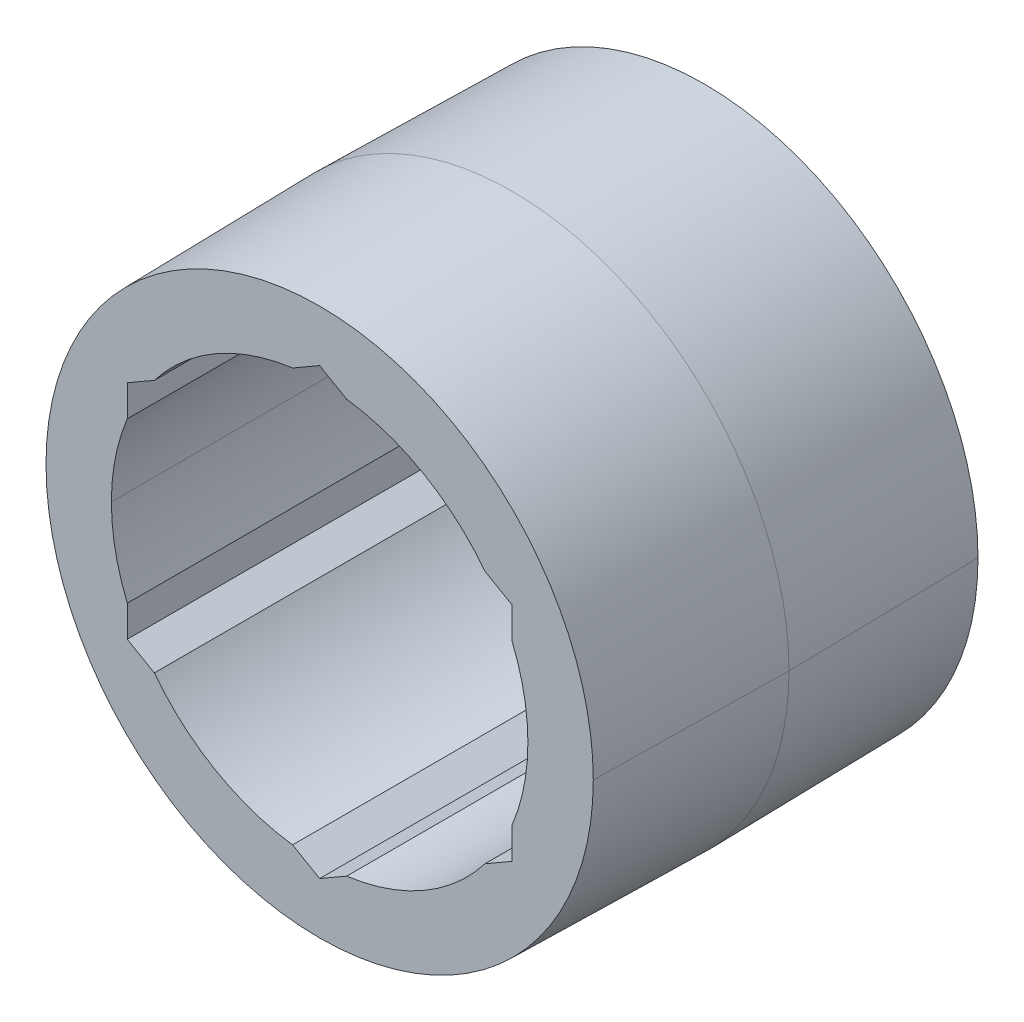
ISO-10303-21;
HEADER;
FILE_DESCRIPTION(('STEP AP214'),'2;1');
FILE_NAME('part.step','',(''),(''),'','','');
FILE_SCHEMA(('AUTOMOTIVE_DESIGN { 1 0 10303 214 1 1 1 1 }'));
ENDSEC;
DATA;
#1=APPLICATION_CONTEXT('core data for automotive mechanical design processes');
#2=APPLICATION_PROTOCOL_DEFINITION('international standard','automotive_design',2000,#1);
#3=PRODUCT_CONTEXT('',#1,'mechanical');
#4=PRODUCT('Part','Part','',(#3));
#5=PRODUCT_RELATED_PRODUCT_CATEGORY('part','',(#4));
#6=PRODUCT_DEFINITION_FORMATION('','',#4);
#7=PRODUCT_DEFINITION_CONTEXT('part definition',#1,'design');
#8=PRODUCT_DEFINITION('design','',#6,#7);
#9=PRODUCT_DEFINITION_SHAPE('','',#8);
#10=(LENGTH_UNIT() NAMED_UNIT(*) SI_UNIT(.MILLI.,.METRE.));
#11=(NAMED_UNIT(*) PLANE_ANGLE_UNIT() SI_UNIT($,.RADIAN.));
#12=(NAMED_UNIT(*) SI_UNIT($,.STERADIAN.) SOLID_ANGLE_UNIT());
#13=UNCERTAINTY_MEASURE_WITH_UNIT(LENGTH_MEASURE(1.E-05),#10,'distance_accuracy_value','');
#14=(GEOMETRIC_REPRESENTATION_CONTEXT(3) GLOBAL_UNCERTAINTY_ASSIGNED_CONTEXT((#13)) GLOBAL_UNIT_ASSIGNED_CONTEXT((#10,
#11,#12)) REPRESENTATION_CONTEXT('',''));
#15=CARTESIAN_POINT('',(0.,0.,0.));
#16=DIRECTION('',(0.,0.,1.));
#17=DIRECTION('',(1.,0.,0.));
#18=AXIS2_PLACEMENT_3D('',#15,#16,#17);
#19=CARTESIAN_POINT('',(0.,0.,-6.35));
#20=DIRECTION('',(0.,0.,1.));
#21=DIRECTION('',(1.,0.,0.));
#22=AXIS2_PLACEMENT_3D('',#19,#20,#21);
#23=PLANE('',#22);
#24=CARTESIAN_POINT('',(0.,0.,-6.35));
#25=DIRECTION('',(0.,0.,1.));
#26=DIRECTION('',(1.,0.,0.));
#27=AXIS2_PLACEMENT_3D('',#24,#25,#26);
#28=CIRCLE('',#27,6.874999966);
#29=CARTESIAN_POINT('',(5.45696042896782,4.18177084608655,-6.35));
#30=VERTEX_POINT('',#29);
#31=CARTESIAN_POINT('',(0.89303957103219,6.81675178197583,-6.35));
#32=VERTEX_POINT('',#31);
#33=EDGE_CURVE('E290',#30,#32,#28,.T.);
#34=ORIENTED_EDGE('',*,*,#33,.T.);
#35=DIRECTION('',(-0.866025403784439,0.5,0.));
#36=VECTOR('',#35,1.);
#37=CARTESIAN_POINT('',(3.175,5.49926131403119,-6.35));
#38=LINE('',#37,#36);
#39=CARTESIAN_POINT('',(0.,7.33234841870825,-6.35));
#40=VERTEX_POINT('',#39);
#41=EDGE_CURVE('E46',#32,#40,#38,.T.);
#42=ORIENTED_EDGE('',*,*,#41,.T.);
#43=DIRECTION('',(-0.866025403784439,-0.5,0.));
#44=VECTOR('',#43,1.);
#45=CARTESIAN_POINT('',(-3.175,5.49926131403119,-6.35));
#46=LINE('',#45,#44);
#47=CARTESIAN_POINT('',(-0.893039571032188,6.81675178197583,-6.35));
#48=VERTEX_POINT('',#47);
#49=EDGE_CURVE('E437',#40,#48,#46,.T.);
#50=ORIENTED_EDGE('',*,*,#49,.T.);
#51=CARTESIAN_POINT('',(0.,0.,-6.35));
#52=DIRECTION('',(0.,0.,1.));
#53=DIRECTION('',(1.,0.,0.));
#54=AXIS2_PLACEMENT_3D('',#51,#52,#53);
#55=CIRCLE('',#54,6.874999966);
#56=CARTESIAN_POINT('',(-5.45696042896781,4.18177084608655,-6.35));
#57=VERTEX_POINT('',#56);
#58=EDGE_CURVE('E413',#48,#57,#55,.T.);
#59=ORIENTED_EDGE('',*,*,#58,.T.);
#60=DIRECTION('',(-0.866025403784439,-0.5,0.));
#61=VECTOR('',#60,1.);
#62=CARTESIAN_POINT('',(-3.175,5.49926131403119,-6.35));
#63=LINE('',#62,#61);
#64=CARTESIAN_POINT('',(-6.35,3.66617420935413,-6.35));
#65=VERTEX_POINT('',#64);
#66=EDGE_CURVE('E387',#57,#65,#63,.T.);
#67=ORIENTED_EDGE('',*,*,#66,.T.);
#68=DIRECTION('',(0.,-1.,0.));
#69=VECTOR('',#68,1.);
#70=CARTESIAN_POINT('',(-6.35,0.,-6.35));
#71=LINE('',#70,#69);
#72=CARTESIAN_POINT('',(-6.35,2.63498093588929,-6.35));
#73=VERTEX_POINT('',#72);
#74=EDGE_CURVE('E262',#65,#73,#71,.T.);
#75=ORIENTED_EDGE('',*,*,#74,.T.);
#76=CARTESIAN_POINT('',(0.,0.,-6.35));
#77=DIRECTION('',(0.,0.,1.));
#78=DIRECTION('',(1.,0.,0.));
#79=AXIS2_PLACEMENT_3D('',#76,#77,#78);
#80=CIRCLE('',#79,6.874999966);
#81=CARTESIAN_POINT('',(-6.874999966,0.,-6.35));
#82=VERTEX_POINT('',#81);
#83=EDGE_CURVE('E274',#73,#82,#80,.T.);
#84=ORIENTED_EDGE('',*,*,#83,.T.);
#85=CARTESIAN_POINT('',(0.,0.,-6.35));
#86=DIRECTION('',(0.,0.,1.));
#87=DIRECTION('',(1.,0.,0.));
#88=AXIS2_PLACEMENT_3D('',#85,#86,#87);
#89=CIRCLE('',#88,6.874999966);
#90=CARTESIAN_POINT('',(-6.35,-2.63498093588929,-6.35));
#91=VERTEX_POINT('',#90);
#92=EDGE_CURVE('E266',#82,#91,#89,.T.);
#93=ORIENTED_EDGE('',*,*,#92,.T.);
#94=DIRECTION('',(0.,-1.,0.));
#95=VECTOR('',#94,1.);
#96=CARTESIAN_POINT('',(-6.35,0.,-6.35));
#97=LINE('',#96,#95);
#98=CARTESIAN_POINT('',(-6.35,-3.66617420935412,-6.35));
#99=VERTEX_POINT('',#98);
#100=EDGE_CURVE('E416',#91,#99,#97,.T.);
#101=ORIENTED_EDGE('',*,*,#100,.T.);
#102=DIRECTION('',(0.866025403784439,-0.5,0.));
#103=VECTOR('',#102,1.);
#104=CARTESIAN_POINT('',(-3.175,-5.49926131403119,-6.35));
#105=LINE('',#104,#103);
#106=CARTESIAN_POINT('',(-5.45696042896782,-4.18177084608655,-6.35));
#107=VERTEX_POINT('',#106);
#108=EDGE_CURVE('E400',#99,#107,#105,.T.);
#109=ORIENTED_EDGE('',*,*,#108,.T.);
#110=CARTESIAN_POINT('',(0.,0.,-6.35));
#111=DIRECTION('',(0.,0.,1.));
#112=DIRECTION('',(1.,0.,0.));
#113=AXIS2_PLACEMENT_3D('',#110,#111,#112);
#114=CIRCLE('',#113,6.874999966);
#115=CARTESIAN_POINT('',(-0.893039571032186,-6.81675178197583,-6.35));
#116=VERTEX_POINT('',#115);
#117=EDGE_CURVE('E390',#107,#116,#114,.T.);
#118=ORIENTED_EDGE('',*,*,#117,.T.);
#119=DIRECTION('',(0.866025403784439,-0.5,0.));
#120=VECTOR('',#119,1.);
#121=CARTESIAN_POINT('',(-3.175,-5.49926131403119,-6.35));
#122=LINE('',#121,#120);
#123=CARTESIAN_POINT('',(0.,-7.33234841870825,-6.35));
#124=VERTEX_POINT('',#123);
#125=EDGE_CURVE('E370',#116,#124,#122,.T.);
#126=ORIENTED_EDGE('',*,*,#125,.T.);
#127=DIRECTION('',(0.866025403784439,0.5,0.));
#128=VECTOR('',#127,1.);
#129=CARTESIAN_POINT('',(3.175,-5.49926131403119,-6.35));
#130=LINE('',#129,#128);
#131=CARTESIAN_POINT('',(0.893039571032181,-6.81675178197583,-6.35));
#132=VERTEX_POINT('',#131);
#133=EDGE_CURVE('E360',#124,#132,#130,.T.);
#134=ORIENTED_EDGE('',*,*,#133,.T.);
#135=CARTESIAN_POINT('',(0.,0.,-6.35));
#136=DIRECTION('',(0.,0.,1.));
#137=DIRECTION('',(1.,0.,0.));
#138=AXIS2_PLACEMENT_3D('',#135,#136,#137);
#139=CIRCLE('',#138,6.874999966);
#140=CARTESIAN_POINT('',(5.45696042896782,-4.18177084608655,-6.35));
#141=VERTEX_POINT('',#140);
#142=EDGE_CURVE('E330',#132,#141,#139,.T.);
#143=ORIENTED_EDGE('',*,*,#142,.T.);
#144=DIRECTION('',(0.866025403784439,0.5,0.));
#145=VECTOR('',#144,1.);
#146=CARTESIAN_POINT('',(3.175,-5.49926131403119,-6.35));
#147=LINE('',#146,#145);
#148=CARTESIAN_POINT('',(6.35,-3.66617420935412,-6.35));
#149=VERTEX_POINT('',#148);
#150=EDGE_CURVE('E256',#141,#149,#147,.T.);
#151=ORIENTED_EDGE('',*,*,#150,.T.);
#152=DIRECTION('',(0.,1.,0.));
#153=VECTOR('',#152,1.);
#154=CARTESIAN_POINT('',(6.35,0.,-6.35));
#155=LINE('',#154,#153);
#156=CARTESIAN_POINT('',(6.35,-2.6349809358893,-6.35));
#157=VERTEX_POINT('',#156);
#158=EDGE_CURVE('E316',#149,#157,#155,.T.);
#159=ORIENTED_EDGE('',*,*,#158,.T.);
#160=CARTESIAN_POINT('',(0.,0.,-6.35));
#161=DIRECTION('',(0.,0.,1.));
#162=DIRECTION('',(1.,0.,0.));
#163=AXIS2_PLACEMENT_3D('',#160,#161,#162);
#164=CIRCLE('',#163,6.874999966);
#165=CARTESIAN_POINT('',(6.35,2.6349809358893,-6.35));
#166=VERTEX_POINT('',#165);
#167=EDGE_CURVE('E334',#157,#166,#164,.T.);
#168=ORIENTED_EDGE('',*,*,#167,.T.);
#169=DIRECTION('',(0.,1.,0.));
#170=VECTOR('',#169,1.);
#171=CARTESIAN_POINT('',(6.35,0.,-6.35));
#172=LINE('',#171,#170);
#173=CARTESIAN_POINT('',(6.35,3.66617420935413,-6.35));
#174=VERTEX_POINT('',#173);
#175=EDGE_CURVE('E319',#166,#174,#172,.T.);
#176=ORIENTED_EDGE('',*,*,#175,.T.);
#177=DIRECTION('',(-0.866025403784439,0.5,0.));
#178=VECTOR('',#177,1.);
#179=CARTESIAN_POINT('',(3.175,5.49926131403119,-6.35));
#180=LINE('',#179,#178);
#181=EDGE_CURVE('E305',#174,#30,#180,.T.);
#182=ORIENTED_EDGE('',*,*,#181,.T.);
#183=EDGE_LOOP('',(#34,#42,#50,#59,#67,#75,#84,#93,#101,#109,#118,#126,#134,#143,#151,#159,#168,
#176,#182));
#184=FACE_BOUND('',#183,.T.);
#185=CARTESIAN_POINT('',(0.,0.,-6.35));
#186=DIRECTION('',(0.,0.,1.));
#187=DIRECTION('',(1.,0.,0.));
#188=AXIS2_PLACEMENT_3D('',#185,#186,#187);
#189=CIRCLE('',#188,9.03316033770582);
#190=CARTESIAN_POINT('',(-9.03316033770582,0.,-6.35));
#191=VERTEX_POINT('',#190);
#192=CARTESIAN_POINT('',(9.03316033770582,0.,-6.35));
#193=VERTEX_POINT('',#192);
#194=EDGE_CURVE('E226',#191,#193,#189,.T.);
#195=ORIENTED_EDGE('',*,*,#194,.F.);
#196=CARTESIAN_POINT('',(0.,0.,-6.35));
#197=DIRECTION('',(0.,0.,1.));
#198=DIRECTION('',(1.,0.,0.));
#199=AXIS2_PLACEMENT_3D('',#196,#197,#198);
#200=CIRCLE('',#199,9.03316033770582);
#201=EDGE_CURVE('E10',#193,#191,#200,.T.);
#202=ORIENTED_EDGE('',*,*,#201,.F.);
#203=EDGE_LOOP('',(#195,#202));
#204=FACE_BOUND('',#203,.T.);
#205=ADVANCED_FACE('F15',(#184,#204),#23,.F.);
#206=CARTESIAN_POINT('',(0.,0.,6.35));
#207=DIRECTION('',(0.,0.,1.));
#208=DIRECTION('',(1.,0.,0.));
#209=AXIS2_PLACEMENT_3D('',#206,#207,#208);
#210=PLANE('',#209);
#211=CARTESIAN_POINT('',(0.,0.,6.35));
#212=DIRECTION('',(0.,0.,1.));
#213=DIRECTION('',(1.,0.,0.));
#214=AXIS2_PLACEMENT_3D('',#211,#212,#213);
#215=CIRCLE('',#214,6.874999966);
#216=CARTESIAN_POINT('',(5.45696042896782,4.18177084608655,6.35));
#217=VERTEX_POINT('',#216);
#218=CARTESIAN_POINT('',(0.89303957103219,6.81675178197583,6.35));
#219=VERTEX_POINT('',#218);
#220=EDGE_CURVE('E295',#217,#219,#215,.T.);
#221=ORIENTED_EDGE('',*,*,#220,.F.);
#222=DIRECTION('',(-0.866025403784439,0.5,0.));
#223=VECTOR('',#222,1.);
#224=CARTESIAN_POINT('',(3.175,5.49926131403119,6.35));
#225=LINE('',#224,#223);
#226=CARTESIAN_POINT('',(6.35,3.66617420935413,6.35));
#227=VERTEX_POINT('',#226);
#228=EDGE_CURVE('E312',#227,#217,#225,.T.);
#229=ORIENTED_EDGE('',*,*,#228,.F.);
#230=DIRECTION('',(0.,1.,0.));
#231=VECTOR('',#230,1.);
#232=CARTESIAN_POINT('',(6.35,0.,6.35));
#233=LINE('',#232,#231);
#234=CARTESIAN_POINT('',(6.35,2.6349809358893,6.35));
#235=VERTEX_POINT('',#234);
#236=EDGE_CURVE('E326',#235,#227,#233,.T.);
#237=ORIENTED_EDGE('',*,*,#236,.F.);
#238=CARTESIAN_POINT('',(0.,0.,6.35));
#239=DIRECTION('',(0.,0.,1.));
#240=DIRECTION('',(1.,0.,0.));
#241=AXIS2_PLACEMENT_3D('',#238,#239,#240);
#242=CIRCLE('',#241,6.874999966);
#243=CARTESIAN_POINT('',(6.35,-2.6349809358893,6.35));
#244=VERTEX_POINT('',#243);
#245=EDGE_CURVE('E341',#244,#235,#242,.T.);
#246=ORIENTED_EDGE('',*,*,#245,.F.);
#247=DIRECTION('',(0.,1.,0.));
#248=VECTOR('',#247,1.);
#249=CARTESIAN_POINT('',(6.35,0.,6.35));
#250=LINE('',#249,#248);
#251=CARTESIAN_POINT('',(6.35,-3.66617420935412,6.35));
#252=VERTEX_POINT('',#251);
#253=EDGE_CURVE('E254',#252,#244,#250,.T.);
#254=ORIENTED_EDGE('',*,*,#253,.F.);
#255=DIRECTION('',(0.866025403784439,0.5,0.));
#256=VECTOR('',#255,1.);
#257=CARTESIAN_POINT('',(3.175,-5.49926131403119,6.35));
#258=LINE('',#257,#256);
#259=CARTESIAN_POINT('',(5.45696042896782,-4.18177084608655,6.35));
#260=VERTEX_POINT('',#259);
#261=EDGE_CURVE('E327',#260,#252,#258,.T.);
#262=ORIENTED_EDGE('',*,*,#261,.F.);
#263=CARTESIAN_POINT('',(0.,0.,6.35));
#264=DIRECTION('',(0.,0.,1.));
#265=DIRECTION('',(1.,0.,0.));
#266=AXIS2_PLACEMENT_3D('',#263,#264,#265);
#267=CIRCLE('',#266,6.874999966);
#268=CARTESIAN_POINT('',(0.893039571032181,-6.81675178197583,6.35));
#269=VERTEX_POINT('',#268);
#270=EDGE_CURVE('E357',#269,#260,#267,.T.);
#271=ORIENTED_EDGE('',*,*,#270,.F.);
#272=DIRECTION('',(0.866025403784439,0.5,0.));
#273=VECTOR('',#272,1.);
#274=CARTESIAN_POINT('',(3.175,-5.49926131403119,6.35));
#275=LINE('',#274,#273);
#276=CARTESIAN_POINT('',(0.,-7.33234841870825,6.35));
#277=VERTEX_POINT('',#276);
#278=EDGE_CURVE('E367',#277,#269,#275,.T.);
#279=ORIENTED_EDGE('',*,*,#278,.F.);
#280=DIRECTION('',(0.866025403784439,-0.5,0.));
#281=VECTOR('',#280,1.);
#282=CARTESIAN_POINT('',(-3.175,-5.49926131403119,6.35));
#283=LINE('',#282,#281);
#284=CARTESIAN_POINT('',(-0.893039571032186,-6.81675178197583,6.35));
#285=VERTEX_POINT('',#284);
#286=EDGE_CURVE('E381',#285,#277,#283,.T.);
#287=ORIENTED_EDGE('',*,*,#286,.F.);
#288=CARTESIAN_POINT('',(0.,0.,6.35));
#289=DIRECTION('',(0.,0.,1.));
#290=DIRECTION('',(1.,0.,0.));
#291=AXIS2_PLACEMENT_3D('',#288,#289,#290);
#292=CIRCLE('',#291,6.874999966);
#293=CARTESIAN_POINT('',(-5.45696042896782,-4.18177084608655,6.35));
#294=VERTEX_POINT('',#293);
#295=EDGE_CURVE('E397',#294,#285,#292,.T.);
#296=ORIENTED_EDGE('',*,*,#295,.F.);
#297=DIRECTION('',(0.866025403784439,-0.5,0.));
#298=VECTOR('',#297,1.);
#299=CARTESIAN_POINT('',(-3.175,-5.49926131403119,6.35));
#300=LINE('',#299,#298);
#301=CARTESIAN_POINT('',(-6.35,-3.66617420935412,6.35));
#302=VERTEX_POINT('',#301);
#303=EDGE_CURVE('E407',#302,#294,#300,.T.);
#304=ORIENTED_EDGE('',*,*,#303,.F.);
#305=DIRECTION('',(0.,-1.,0.));
#306=VECTOR('',#305,1.);
#307=CARTESIAN_POINT('',(-6.35,0.,6.35));
#308=LINE('',#307,#306);
#309=CARTESIAN_POINT('',(-6.35,-2.63498093588929,6.35));
#310=VERTEX_POINT('',#309);
#311=EDGE_CURVE('E284',#310,#302,#308,.T.);
#312=ORIENTED_EDGE('',*,*,#311,.F.);
#313=CARTESIAN_POINT('',(0.,0.,6.35));
#314=DIRECTION('',(0.,0.,1.));
#315=DIRECTION('',(1.,0.,0.));
#316=AXIS2_PLACEMENT_3D('',#313,#314,#315);
#317=CIRCLE('',#316,6.874999966);
#318=CARTESIAN_POINT('',(-6.874999966,0.,6.35));
#319=VERTEX_POINT('',#318);
#320=EDGE_CURVE('E281',#319,#310,#317,.T.);
#321=ORIENTED_EDGE('',*,*,#320,.F.);
#322=CARTESIAN_POINT('',(0.,0.,6.35));
#323=DIRECTION('',(0.,0.,1.));
#324=DIRECTION('',(1.,0.,0.));
#325=AXIS2_PLACEMENT_3D('',#322,#323,#324);
#326=CIRCLE('',#325,6.874999966);
#327=CARTESIAN_POINT('',(-6.35,2.63498093588929,6.35));
#328=VERTEX_POINT('',#327);
#329=EDGE_CURVE('E230',#328,#319,#326,.T.);
#330=ORIENTED_EDGE('',*,*,#329,.F.);
#331=DIRECTION('',(0.,-1.,0.));
#332=VECTOR('',#331,1.);
#333=CARTESIAN_POINT('',(-6.35,0.,6.35));
#334=LINE('',#333,#332);
#335=CARTESIAN_POINT('',(-6.35,3.66617420935413,6.35));
#336=VERTEX_POINT('',#335);
#337=EDGE_CURVE('E377',#336,#328,#334,.T.);
#338=ORIENTED_EDGE('',*,*,#337,.F.);
#339=DIRECTION('',(-0.866025403784439,-0.5,0.));
#340=VECTOR('',#339,1.);
#341=CARTESIAN_POINT('',(-3.175,5.49926131403119,6.35));
#342=LINE('',#341,#340);
#343=CARTESIAN_POINT('',(-5.45696042896781,4.18177084608655,6.35));
#344=VERTEX_POINT('',#343);
#345=EDGE_CURVE('E386',#344,#336,#342,.T.);
#346=ORIENTED_EDGE('',*,*,#345,.F.);
#347=CARTESIAN_POINT('',(0.,0.,6.35));
#348=DIRECTION('',(0.,0.,1.));
#349=DIRECTION('',(1.,0.,0.));
#350=AXIS2_PLACEMENT_3D('',#347,#348,#349);
#351=CIRCLE('',#350,6.874999966);
#352=CARTESIAN_POINT('',(-0.893039571032188,6.81675178197583,6.35));
#353=VERTEX_POINT('',#352);
#354=EDGE_CURVE('E412',#353,#344,#351,.T.);
#355=ORIENTED_EDGE('',*,*,#354,.F.);
#356=DIRECTION('',(-0.866025403784439,-0.5,0.));
#357=VECTOR('',#356,1.);
#358=CARTESIAN_POINT('',(-3.175,5.49926131403119,6.35));
#359=LINE('',#358,#357);
#360=CARTESIAN_POINT('',(0.,7.33234841870825,6.35));
#361=VERTEX_POINT('',#360);
#362=EDGE_CURVE('E441',#361,#353,#359,.T.);
#363=ORIENTED_EDGE('',*,*,#362,.F.);
#364=DIRECTION('',(-0.866025403784439,0.5,0.));
#365=VECTOR('',#364,1.);
#366=CARTESIAN_POINT('',(3.175,5.49926131403119,6.35));
#367=LINE('',#366,#365);
#368=EDGE_CURVE('E23',#219,#361,#367,.T.);
#369=ORIENTED_EDGE('',*,*,#368,.F.);
#370=EDGE_LOOP('',(#221,#229,#237,#246,#254,#262,#271,#279,#287,#296,#304,#312,#321,#330,#338,
#346,#355,#363,#369));
#371=FACE_BOUND('',#370,.T.);
#372=CARTESIAN_POINT('',(0.,0.,6.35));
#373=DIRECTION('',(0.,0.,1.));
#374=DIRECTION('',(1.,0.,0.));
#375=AXIS2_PLACEMENT_3D('',#372,#373,#374);
#376=CIRCLE('',#375,9.03316033770582);
#377=CARTESIAN_POINT('',(9.03316033770582,0.,6.35));
#378=VERTEX_POINT('',#377);
#379=CARTESIAN_POINT('',(-9.03316033770582,0.,6.35));
#380=VERTEX_POINT('',#379);
#381=EDGE_CURVE('E247',#378,#380,#376,.T.);
#382=ORIENTED_EDGE('',*,*,#381,.T.);
#383=CARTESIAN_POINT('',(0.,0.,6.35));
#384=DIRECTION('',(0.,0.,1.));
#385=DIRECTION('',(1.,0.,0.));
#386=AXIS2_PLACEMENT_3D('',#383,#384,#385);
#387=CIRCLE('',#386,9.03316033770582);
#388=EDGE_CURVE('E240',#380,#378,#387,.T.);
#389=ORIENTED_EDGE('',*,*,#388,.T.);
#390=EDGE_LOOP('',(#382,#389));
#391=FACE_BOUND('',#390,.T.);
#392=ADVANCED_FACE('F585',(#371,#391),#210,.T.);
#393=CARTESIAN_POINT('',(0.,0.,0.));
#394=DIRECTION('',(0.,0.,1.));
#395=DIRECTION('',(-1.,0.,0.));
#396=AXIS2_PLACEMENT_3D('',#393,#394,#395);
#397=CONICAL_SURFACE('',#396,9.144,0.0174532925199415);
#398=DIRECTION('',(0.0174524064372835,0.,0.999847695156391));
#399=VECTOR('',#398,1.);
#400=CARTESIAN_POINT('',(9.144,0.,0.));
#401=LINE('',#400,#399);
#402=CARTESIAN_POINT('',(9.144,0.,0.));
#403=VERTEX_POINT('',#402);
#404=EDGE_CURVE('E220',#193,#403,#401,.T.);
#405=ORIENTED_EDGE('',*,*,#404,.F.);
#406=ORIENTED_EDGE('',*,*,#201,.T.);
#407=DIRECTION('',(-0.0174524064372835,0.,0.999847695156391));
#408=VECTOR('',#407,1.);
#409=CARTESIAN_POINT('',(-9.144,0.,0.));
#410=LINE('',#409,#408);
#411=CARTESIAN_POINT('',(-9.144,0.,0.));
#412=VERTEX_POINT('',#411);
#413=EDGE_CURVE('E217',#191,#412,#410,.T.);
#414=ORIENTED_EDGE('',*,*,#413,.T.);
#415=CARTESIAN_POINT('',(0.,0.,0.));
#416=DIRECTION('',(0.,0.,1.));
#417=DIRECTION('',(1.,0.,0.));
#418=AXIS2_PLACEMENT_3D('',#415,#416,#417);
#419=CIRCLE('',#418,9.144);
#420=EDGE_CURVE('E250',#403,#412,#419,.T.);
#421=ORIENTED_EDGE('',*,*,#420,.F.);
#422=EDGE_LOOP('',(#405,#406,#414,#421));
#423=FACE_BOUND('',#422,.T.);
#424=ADVANCED_FACE('F216',(#423),#397,.T.);
#425=CARTESIAN_POINT('',(3.175,5.49926131403119,6.35));
#426=DIRECTION('',(-0.5,-0.866025403784439,0.));
#427=DIRECTION('',(-0.866025403784439,0.5,0.));
#428=AXIS2_PLACEMENT_3D('',#425,#426,#427);
#429=PLANE('',#428);
#430=ORIENTED_EDGE('',*,*,#41,.F.);
#431=DIRECTION('',(0.,0.,-1.));
#432=VECTOR('',#431,1.);
#433=CARTESIAN_POINT('',(0.89303957103219,6.81675178197583,6.35));
#434=LINE('',#433,#432);
#435=EDGE_CURVE('E299',#219,#32,#434,.T.);
#436=ORIENTED_EDGE('',*,*,#435,.F.);
#437=ORIENTED_EDGE('',*,*,#368,.T.);
#438=DIRECTION('',(0.,0.,-1.));
#439=VECTOR('',#438,1.);
#440=CARTESIAN_POINT('',(0.,7.33234841870825,6.35));
#441=LINE('',#440,#439);
#442=EDGE_CURVE('E440',#361,#40,#441,.T.);
#443=ORIENTED_EDGE('',*,*,#442,.T.);
#444=EDGE_LOOP('',(#430,#436,#437,#443));
#445=FACE_BOUND('',#444,.T.);
#446=ADVANCED_FACE('F601',(#445),#429,.T.);
#447=CARTESIAN_POINT('',(-3.175,5.49926131403119,6.35));
#448=DIRECTION('',(0.5,-0.866025403784439,0.));
#449=DIRECTION('',(0.,0.,-1.));
#450=AXIS2_PLACEMENT_3D('',#447,#448,#449);
#451=PLANE('',#450);
#452=ORIENTED_EDGE('',*,*,#49,.F.);
#453=ORIENTED_EDGE('',*,*,#442,.F.);
#454=ORIENTED_EDGE('',*,*,#362,.T.);
#455=DIRECTION('',(0.,0.,-1.));
#456=VECTOR('',#455,1.);
#457=CARTESIAN_POINT('',(-0.893039571032188,6.81675178197583,6.35));
#458=LINE('',#457,#456);
#459=EDGE_CURVE('E408',#353,#48,#458,.T.);
#460=ORIENTED_EDGE('',*,*,#459,.T.);
#461=EDGE_LOOP('',(#452,#453,#454,#460));
#462=FACE_BOUND('',#461,.T.);
#463=ADVANCED_FACE('F695',(#462),#451,.T.);
#464=CARTESIAN_POINT('',(0.,0.,6.35));
#465=DIRECTION('',(0.,0.,-1.));
#466=DIRECTION('',(-1.,0.,0.));
#467=AXIS2_PLACEMENT_3D('',#464,#465,#466);
#468=CYLINDRICAL_SURFACE('',#467,6.874999966);
#469=ORIENTED_EDGE('',*,*,#58,.F.);
#470=ORIENTED_EDGE('',*,*,#459,.F.);
#471=ORIENTED_EDGE('',*,*,#354,.T.);
#472=DIRECTION('',(0.,0.,-1.));
#473=VECTOR('',#472,1.);
#474=CARTESIAN_POINT('',(-5.45696042896781,4.18177084608655,6.35));
#475=LINE('',#474,#473);
#476=EDGE_CURVE('E382',#344,#57,#475,.T.);
#477=ORIENTED_EDGE('',*,*,#476,.T.);
#478=EDGE_LOOP('',(#469,#470,#471,#477));
#479=FACE_BOUND('',#478,.T.);
#480=ADVANCED_FACE('F684',(#479),#468,.F.);
#481=CARTESIAN_POINT('',(-3.175,5.49926131403119,6.35));
#482=DIRECTION('',(0.5,-0.866025403784439,0.));
#483=DIRECTION('',(0.,0.,-1.));
#484=AXIS2_PLACEMENT_3D('',#481,#482,#483);
#485=PLANE('',#484);
#486=ORIENTED_EDGE('',*,*,#66,.F.);
#487=ORIENTED_EDGE('',*,*,#476,.F.);
#488=ORIENTED_EDGE('',*,*,#345,.T.);
#489=DIRECTION('',(0.,0.,-1.));
#490=VECTOR('',#489,1.);
#491=CARTESIAN_POINT('',(-6.35,3.66617420935413,6.35));
#492=LINE('',#491,#490);
#493=EDGE_CURVE('E265',#336,#65,#492,.T.);
#494=ORIENTED_EDGE('',*,*,#493,.T.);
#495=EDGE_LOOP('',(#486,#487,#488,#494));
#496=FACE_BOUND('',#495,.T.);
#497=ADVANCED_FACE('F673',(#496),#485,.T.);
#498=CARTESIAN_POINT('',(-6.35,0.,6.35));
#499=DIRECTION('',(1.,0.,0.));
#500=DIRECTION('',(0.,-1.,0.));
#501=AXIS2_PLACEMENT_3D('',#498,#499,#500);
#502=PLANE('',#501);
#503=ORIENTED_EDGE('',*,*,#74,.F.);
#504=ORIENTED_EDGE('',*,*,#493,.F.);
#505=ORIENTED_EDGE('',*,*,#337,.T.);
#506=DIRECTION('',(0.,0.,-1.));
#507=VECTOR('',#506,1.);
#508=CARTESIAN_POINT('',(-6.35,2.63498093588929,6.35));
#509=LINE('',#508,#507);
#510=EDGE_CURVE('E243',#328,#73,#509,.T.);
#511=ORIENTED_EDGE('',*,*,#510,.T.);
#512=EDGE_LOOP('',(#503,#504,#505,#511));
#513=FACE_BOUND('',#512,.T.);
#514=ADVANCED_FACE('F662',(#513),#502,.T.);
#515=CARTESIAN_POINT('',(0.,0.,6.35));
#516=DIRECTION('',(0.,0.,-1.));
#517=DIRECTION('',(-1.,0.,0.));
#518=AXIS2_PLACEMENT_3D('',#515,#516,#517);
#519=CYLINDRICAL_SURFACE('',#518,6.874999966);
#520=DIRECTION('',(0.,0.,-1.));
#521=VECTOR('',#520,1.);
#522=CARTESIAN_POINT('',(-6.874999966,0.,6.35));
#523=LINE('',#522,#521);
#524=EDGE_CURVE('E270',#319,#82,#523,.T.);
#525=ORIENTED_EDGE('',*,*,#524,.F.);
#526=ORIENTED_EDGE('',*,*,#320,.T.);
#527=DIRECTION('',(0.,0.,-1.));
#528=VECTOR('',#527,1.);
#529=CARTESIAN_POINT('',(-6.35,-2.63498093588929,6.35));
#530=LINE('',#529,#528);
#531=EDGE_CURVE('E419',#310,#91,#530,.T.);
#532=ORIENTED_EDGE('',*,*,#531,.T.);
#533=ORIENTED_EDGE('',*,*,#92,.F.);
#534=EDGE_LOOP('',(#525,#526,#532,#533));
#535=FACE_BOUND('',#534,.T.);
#536=ADVANCED_FACE('F481',(#535),#519,.F.);
#537=CARTESIAN_POINT('',(-6.35,0.,6.35));
#538=DIRECTION('',(1.,0.,0.));
#539=DIRECTION('',(0.,-1.,0.));
#540=AXIS2_PLACEMENT_3D('',#537,#538,#539);
#541=PLANE('',#540);
#542=ORIENTED_EDGE('',*,*,#100,.F.);
#543=ORIENTED_EDGE('',*,*,#531,.F.);
#544=ORIENTED_EDGE('',*,*,#311,.T.);
#545=DIRECTION('',(0.,0.,-1.));
#546=VECTOR('',#545,1.);
#547=CARTESIAN_POINT('',(-6.35,-3.66617420935412,6.35));
#548=LINE('',#547,#546);
#549=EDGE_CURVE('E403',#302,#99,#548,.T.);
#550=ORIENTED_EDGE('',*,*,#549,.T.);
#551=EDGE_LOOP('',(#542,#543,#544,#550));
#552=FACE_BOUND('',#551,.T.);
#553=ADVANCED_FACE('F475',(#552),#541,.T.);
#554=CARTESIAN_POINT('',(-3.175,-5.49926131403119,6.35));
#555=DIRECTION('',(0.5,0.866025403784439,0.));
#556=DIRECTION('',(0.,0.,-1.));
#557=AXIS2_PLACEMENT_3D('',#554,#555,#556);
#558=PLANE('',#557);
#559=ORIENTED_EDGE('',*,*,#108,.F.);
#560=ORIENTED_EDGE('',*,*,#549,.F.);
#561=ORIENTED_EDGE('',*,*,#303,.T.);
#562=DIRECTION('',(0.,0.,-1.));
#563=VECTOR('',#562,1.);
#564=CARTESIAN_POINT('',(-5.45696042896782,-4.18177084608655,6.35));
#565=LINE('',#564,#563);
#566=EDGE_CURVE('E393',#294,#107,#565,.T.);
#567=ORIENTED_EDGE('',*,*,#566,.T.);
#568=EDGE_LOOP('',(#559,#560,#561,#567));
#569=FACE_BOUND('',#568,.T.);
#570=ADVANCED_FACE('F480',(#569),#558,.T.);
#571=CARTESIAN_POINT('',(0.,0.,6.35));
#572=DIRECTION('',(0.,0.,-1.));
#573=DIRECTION('',(-1.,0.,0.));
#574=AXIS2_PLACEMENT_3D('',#571,#572,#573);
#575=CYLINDRICAL_SURFACE('',#574,6.874999966);
#576=ORIENTED_EDGE('',*,*,#117,.F.);
#577=ORIENTED_EDGE('',*,*,#566,.F.);
#578=ORIENTED_EDGE('',*,*,#295,.T.);
#579=DIRECTION('',(0.,0.,-1.));
#580=VECTOR('',#579,1.);
#581=CARTESIAN_POINT('',(-0.893039571032186,-6.81675178197583,6.35));
#582=LINE('',#581,#580);
#583=EDGE_CURVE('E373',#285,#116,#582,.T.);
#584=ORIENTED_EDGE('',*,*,#583,.T.);
#585=EDGE_LOOP('',(#576,#577,#578,#584));
#586=FACE_BOUND('',#585,.T.);
#587=ADVANCED_FACE('F624',(#586),#575,.F.);
#588=CARTESIAN_POINT('',(-3.175,-5.49926131403119,6.35));
#589=DIRECTION('',(0.5,0.866025403784439,0.));
#590=DIRECTION('',(0.,0.,-1.));
#591=AXIS2_PLACEMENT_3D('',#588,#589,#590);
#592=PLANE('',#591);
#593=ORIENTED_EDGE('',*,*,#125,.F.);
#594=ORIENTED_EDGE('',*,*,#583,.F.);
#595=ORIENTED_EDGE('',*,*,#286,.T.);
#596=DIRECTION('',(0.,0.,-1.));
#597=VECTOR('',#596,1.);
#598=CARTESIAN_POINT('',(0.,-7.33234841870825,6.35));
#599=LINE('',#598,#597);
#600=EDGE_CURVE('E363',#277,#124,#599,.T.);
#601=ORIENTED_EDGE('',*,*,#600,.T.);
#602=EDGE_LOOP('',(#593,#594,#595,#601));
#603=FACE_BOUND('',#602,.T.);
#604=ADVANCED_FACE('F619',(#603),#592,.T.);
#605=CARTESIAN_POINT('',(3.175,-5.49926131403119,6.35));
#606=DIRECTION('',(-0.5,0.866025403784439,0.));
#607=DIRECTION('',(0.,0.,1.));
#608=AXIS2_PLACEMENT_3D('',#605,#606,#607);
#609=PLANE('',#608);
#610=ORIENTED_EDGE('',*,*,#133,.F.);
#611=ORIENTED_EDGE('',*,*,#600,.F.);
#612=ORIENTED_EDGE('',*,*,#278,.T.);
#613=DIRECTION('',(0.,0.,-1.));
#614=VECTOR('',#613,1.);
#615=CARTESIAN_POINT('',(0.893039571032181,-6.81675178197583,6.35));
#616=LINE('',#615,#614);
#617=EDGE_CURVE('E353',#269,#132,#616,.T.);
#618=ORIENTED_EDGE('',*,*,#617,.T.);
#619=EDGE_LOOP('',(#610,#611,#612,#618));
#620=FACE_BOUND('',#619,.T.);
#621=ADVANCED_FACE('F611',(#620),#609,.T.);
#622=CARTESIAN_POINT('',(0.,0.,6.35));
#623=DIRECTION('',(0.,0.,-1.));
#624=DIRECTION('',(-1.,0.,0.));
#625=AXIS2_PLACEMENT_3D('',#622,#623,#624);
#626=CYLINDRICAL_SURFACE('',#625,6.874999966);
#627=ORIENTED_EDGE('',*,*,#142,.F.);
#628=ORIENTED_EDGE('',*,*,#617,.F.);
#629=ORIENTED_EDGE('',*,*,#270,.T.);
#630=DIRECTION('',(0.,0.,-1.));
#631=VECTOR('',#630,1.);
#632=CARTESIAN_POINT('',(5.45696042896782,-4.18177084608655,6.35));
#633=LINE('',#632,#631);
#634=EDGE_CURVE('E331',#260,#141,#633,.T.);
#635=ORIENTED_EDGE('',*,*,#634,.T.);
#636=EDGE_LOOP('',(#627,#628,#629,#635));
#637=FACE_BOUND('',#636,.T.);
#638=ADVANCED_FACE('F465',(#637),#626,.F.);
#639=CARTESIAN_POINT('',(3.175,-5.49926131403119,6.35));
#640=DIRECTION('',(-0.5,0.866025403784439,0.));
#641=DIRECTION('',(0.,0.,1.));
#642=AXIS2_PLACEMENT_3D('',#639,#640,#641);
#643=PLANE('',#642);
#644=ORIENTED_EDGE('',*,*,#150,.F.);
#645=ORIENTED_EDGE('',*,*,#634,.F.);
#646=ORIENTED_EDGE('',*,*,#261,.T.);
#647=DIRECTION('',(0.,0.,-1.));
#648=VECTOR('',#647,1.);
#649=CARTESIAN_POINT('',(6.35,-3.66617420935412,6.35));
#650=LINE('',#649,#648);
#651=EDGE_CURVE('E257',#252,#149,#650,.T.);
#652=ORIENTED_EDGE('',*,*,#651,.T.);
#653=EDGE_LOOP('',(#644,#645,#646,#652));
#654=FACE_BOUND('',#653,.T.);
#655=ADVANCED_FACE('F459',(#654),#643,.T.);
#656=CARTESIAN_POINT('',(6.35,0.,6.35));
#657=DIRECTION('',(-1.,0.,0.));
#658=DIRECTION('',(0.,1.,0.));
#659=AXIS2_PLACEMENT_3D('',#656,#657,#658);
#660=PLANE('',#659);
#661=ORIENTED_EDGE('',*,*,#158,.F.);
#662=ORIENTED_EDGE('',*,*,#651,.F.);
#663=ORIENTED_EDGE('',*,*,#253,.T.);
#664=DIRECTION('',(0.,0.,-1.));
#665=VECTOR('',#664,1.);
#666=CARTESIAN_POINT('',(6.35,-2.6349809358893,6.35));
#667=LINE('',#666,#665);
#668=EDGE_CURVE('E337',#244,#157,#667,.T.);
#669=ORIENTED_EDGE('',*,*,#668,.T.);
#670=EDGE_LOOP('',(#661,#662,#663,#669));
#671=FACE_BOUND('',#670,.T.);
#672=ADVANCED_FACE('F464',(#671),#660,.T.);
#673=CARTESIAN_POINT('',(0.,0.,6.35));
#674=DIRECTION('',(0.,0.,-1.));
#675=DIRECTION('',(-1.,0.,0.));
#676=AXIS2_PLACEMENT_3D('',#673,#674,#675);
#677=CYLINDRICAL_SURFACE('',#676,6.874999966);
#678=ORIENTED_EDGE('',*,*,#167,.F.);
#679=ORIENTED_EDGE('',*,*,#668,.F.);
#680=ORIENTED_EDGE('',*,*,#245,.T.);
#681=DIRECTION('',(0.,0.,-1.));
#682=VECTOR('',#681,1.);
#683=CARTESIAN_POINT('',(6.35,2.6349809358893,6.35));
#684=LINE('',#683,#682);
#685=EDGE_CURVE('E322',#235,#166,#684,.T.);
#686=ORIENTED_EDGE('',*,*,#685,.T.);
#687=EDGE_LOOP('',(#678,#679,#680,#686));
#688=FACE_BOUND('',#687,.T.);
#689=ADVANCED_FACE('F504',(#688),#677,.F.);
#690=CARTESIAN_POINT('',(6.35,0.,6.35));
#691=DIRECTION('',(-1.,0.,0.));
#692=DIRECTION('',(0.,1.,0.));
#693=AXIS2_PLACEMENT_3D('',#690,#691,#692);
#694=PLANE('',#693);
#695=ORIENTED_EDGE('',*,*,#175,.F.);
#696=ORIENTED_EDGE('',*,*,#685,.F.);
#697=ORIENTED_EDGE('',*,*,#236,.T.);
#698=DIRECTION('',(0.,0.,-1.));
#699=VECTOR('',#698,1.);
#700=CARTESIAN_POINT('',(6.35,3.66617420935413,6.35));
#701=LINE('',#700,#699);
#702=EDGE_CURVE('E308',#227,#174,#701,.T.);
#703=ORIENTED_EDGE('',*,*,#702,.T.);
#704=EDGE_LOOP('',(#695,#696,#697,#703));
#705=FACE_BOUND('',#704,.T.);
#706=ADVANCED_FACE('F559',(#705),#694,.T.);
#707=CARTESIAN_POINT('',(3.175,5.49926131403119,6.35));
#708=DIRECTION('',(-0.5,-0.866025403784439,0.));
#709=DIRECTION('',(-0.866025403784439,0.5,0.));
#710=AXIS2_PLACEMENT_3D('',#707,#708,#709);
#711=PLANE('',#710);
#712=ORIENTED_EDGE('',*,*,#181,.F.);
#713=ORIENTED_EDGE('',*,*,#702,.F.);
#714=ORIENTED_EDGE('',*,*,#228,.T.);
#715=DIRECTION('',(0.,0.,-1.));
#716=VECTOR('',#715,1.);
#717=CARTESIAN_POINT('',(5.45696042896782,4.18177084608655,6.35));
#718=LINE('',#717,#716);
#719=EDGE_CURVE('E291',#217,#30,#718,.T.);
#720=ORIENTED_EDGE('',*,*,#719,.T.);
#721=EDGE_LOOP('',(#712,#713,#714,#720));
#722=FACE_BOUND('',#721,.T.);
#723=ADVANCED_FACE('F548',(#722),#711,.T.);
#724=CARTESIAN_POINT('',(0.,0.,6.35));
#725=DIRECTION('',(0.,0.,-1.));
#726=DIRECTION('',(-1.,0.,0.));
#727=AXIS2_PLACEMENT_3D('',#724,#725,#726);
#728=CYLINDRICAL_SURFACE('',#727,6.874999966);
#729=ORIENTED_EDGE('',*,*,#33,.F.);
#730=ORIENTED_EDGE('',*,*,#719,.F.);
#731=ORIENTED_EDGE('',*,*,#220,.T.);
#732=ORIENTED_EDGE('',*,*,#435,.T.);
#733=EDGE_LOOP('',(#729,#730,#731,#732));
#734=FACE_BOUND('',#733,.T.);
#735=ADVANCED_FACE('F537',(#734),#728,.F.);
#736=CARTESIAN_POINT('',(0.,0.,0.));
#737=DIRECTION('',(0.,0.,-1.));
#738=DIRECTION('',(1.,0.,0.));
#739=AXIS2_PLACEMENT_3D('',#736,#737,#738);
#740=CONICAL_SURFACE('',#739,9.144,0.0174532925199415);
#741=DIRECTION('',(-0.0174524064372835,0.,-0.999847695156391));
#742=VECTOR('',#741,1.);
#743=CARTESIAN_POINT('',(-9.144,0.,0.));
#744=LINE('',#743,#742);
#745=EDGE_CURVE('E242',#380,#412,#744,.T.);
#746=ORIENTED_EDGE('',*,*,#745,.F.);
#747=ORIENTED_EDGE('',*,*,#381,.F.);
#748=DIRECTION('',(0.0174524064372835,0.,-0.999847695156391));
#749=VECTOR('',#748,1.);
#750=CARTESIAN_POINT('',(9.144,0.,0.));
#751=LINE('',#750,#749);
#752=EDGE_CURVE('E251',#378,#403,#751,.T.);
#753=ORIENTED_EDGE('',*,*,#752,.T.);
#754=ORIENTED_EDGE('',*,*,#420,.T.);
#755=EDGE_LOOP('',(#746,#747,#753,#754));
#756=FACE_BOUND('',#755,.T.);
#757=ADVANCED_FACE('F526',(#756),#740,.T.);
#758=CARTESIAN_POINT('',(0.,0.,0.));
#759=DIRECTION('',(0.,0.,-1.));
#760=DIRECTION('',(1.,0.,0.));
#761=AXIS2_PLACEMENT_3D('',#758,#759,#760);
#762=CONICAL_SURFACE('',#761,9.144,0.0174532925199415);
#763=ORIENTED_EDGE('',*,*,#388,.F.);
#764=ORIENTED_EDGE('',*,*,#745,.T.);
#765=CARTESIAN_POINT('',(0.,0.,0.));
#766=DIRECTION('',(0.,0.,1.));
#767=DIRECTION('',(1.,0.,0.));
#768=AXIS2_PLACEMENT_3D('',#765,#766,#767);
#769=CIRCLE('',#768,9.144);
#770=EDGE_CURVE('E228',#412,#403,#769,.T.);
#771=ORIENTED_EDGE('',*,*,#770,.T.);
#772=ORIENTED_EDGE('',*,*,#752,.F.);
#773=EDGE_LOOP('',(#763,#764,#771,#772));
#774=FACE_BOUND('',#773,.T.);
#775=ADVANCED_FACE('F515',(#774),#762,.T.);
#776=CARTESIAN_POINT('',(0.,0.,6.35));
#777=DIRECTION('',(0.,0.,-1.));
#778=DIRECTION('',(-1.,0.,0.));
#779=AXIS2_PLACEMENT_3D('',#776,#777,#778);
#780=CYLINDRICAL_SURFACE('',#779,6.874999966);
#781=ORIENTED_EDGE('',*,*,#329,.T.);
#782=ORIENTED_EDGE('',*,*,#524,.T.);
#783=ORIENTED_EDGE('',*,*,#83,.F.);
#784=ORIENTED_EDGE('',*,*,#510,.F.);
#785=EDGE_LOOP('',(#781,#782,#783,#784));
#786=FACE_BOUND('',#785,.T.);
#787=ADVANCED_FACE('F494',(#786),#780,.F.);
#788=CARTESIAN_POINT('',(0.,0.,0.));
#789=DIRECTION('',(0.,0.,1.));
#790=DIRECTION('',(-1.,0.,0.));
#791=AXIS2_PLACEMENT_3D('',#788,#789,#790);
#792=CONICAL_SURFACE('',#791,9.144,0.0174532925199415);
#793=ORIENTED_EDGE('',*,*,#194,.T.);
#794=ORIENTED_EDGE('',*,*,#404,.T.);
#795=ORIENTED_EDGE('',*,*,#770,.F.);
#796=ORIENTED_EDGE('',*,*,#413,.F.);
#797=EDGE_LOOP('',(#793,#794,#795,#796));
#798=FACE_BOUND('',#797,.T.);
#799=ADVANCED_FACE('F225',(#798),#792,.T.);
#800=CLOSED_SHELL('',(#205,#392,#424,#446,#463,#480,#497,#514,#536,#553,#570,#587,#604,#621,
#638,#655,#672,#689,#706,#723,#735,#757,#775,#787,#799));
#801=MANIFOLD_SOLID_BREP('B1',#800);
#802=ADVANCED_BREP_SHAPE_REPRESENTATION('',(#18,#801),#14);
#803=SHAPE_DEFINITION_REPRESENTATION(#9,#802);
ENDSEC;
END-ISO-10303-21;
